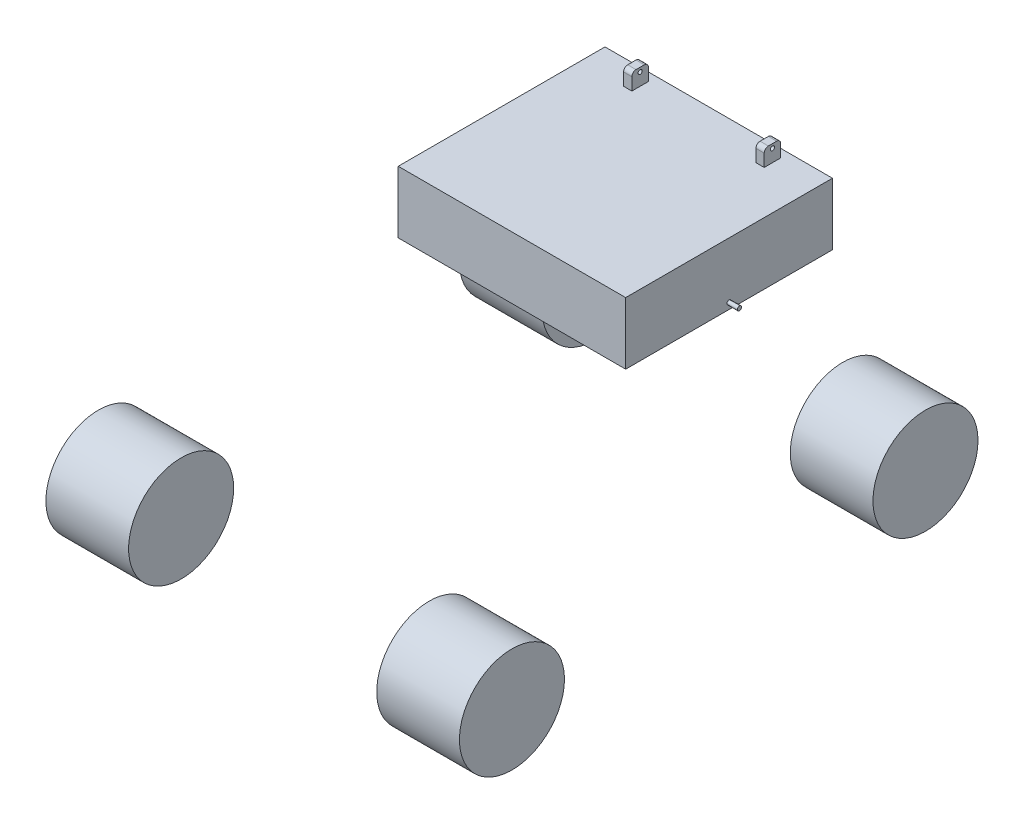
ISO-10303-21;
HEADER;
FILE_DESCRIPTION(('STEP AP214'),'2;1');
FILE_NAME('part.step','',(''),(''),'','','');
FILE_SCHEMA(('AUTOMOTIVE_DESIGN { 1 0 10303 214 1 1 1 1 }'));
ENDSEC;
DATA;
#1=APPLICATION_CONTEXT('core data for automotive mechanical design processes');
#2=APPLICATION_PROTOCOL_DEFINITION('international standard','automotive_design',2000,#1);
#3=PRODUCT_CONTEXT('',#1,'mechanical');
#4=PRODUCT('Part','Part','',(#3));
#5=PRODUCT_RELATED_PRODUCT_CATEGORY('part','',(#4));
#6=PRODUCT_DEFINITION_FORMATION('','',#4);
#7=PRODUCT_DEFINITION_CONTEXT('part definition',#1,'design');
#8=PRODUCT_DEFINITION('design','',#6,#7);
#9=PRODUCT_DEFINITION_SHAPE('','',#8);
#10=(LENGTH_UNIT() NAMED_UNIT(*) SI_UNIT(.MILLI.,.METRE.));
#11=(NAMED_UNIT(*) PLANE_ANGLE_UNIT() SI_UNIT($,.RADIAN.));
#12=(NAMED_UNIT(*) SI_UNIT($,.STERADIAN.) SOLID_ANGLE_UNIT());
#13=UNCERTAINTY_MEASURE_WITH_UNIT(LENGTH_MEASURE(1.E-05),#10,'distance_accuracy_value','');
#14=(GEOMETRIC_REPRESENTATION_CONTEXT(3) GLOBAL_UNCERTAINTY_ASSIGNED_CONTEXT((#13)) GLOBAL_UNIT_ASSIGNED_CONTEXT((#10,
#11,#12)) REPRESENTATION_CONTEXT('',''));
#15=CARTESIAN_POINT('',(0.,0.,0.));
#16=DIRECTION('',(0.,0.,1.));
#17=DIRECTION('',(1.,0.,0.));
#18=AXIS2_PLACEMENT_3D('',#15,#16,#17);
#19=CARTESIAN_POINT('',(275.,500.,0.));
#20=DIRECTION('',(0.,-1.,0.));
#21=DIRECTION('',(0.,0.,-1.));
#22=AXIS2_PLACEMENT_3D('',#19,#20,#21);
#23=PLANE('',#22);
#24=DIRECTION('',(0.,0.,1.));
#25=VECTOR('',#24,1.);
#26=CARTESIAN_POINT('',(-170.,500.,-440.));
#27=LINE('',#26,#25);
#28=CARTESIAN_POINT('',(-170.,500.,-480.));
#29=VERTEX_POINT('',#28);
#30=CARTESIAN_POINT('',(-170.,500.,-440.));
#31=VERTEX_POINT('',#30);
#32=EDGE_CURVE('E186',#29,#31,#27,.T.);
#33=ORIENTED_EDGE('',*,*,#32,.F.);
#34=DIRECTION('',(-1.,0.,0.));
#35=VECTOR('',#34,1.);
#36=CARTESIAN_POINT('',(-170.,500.,-480.));
#37=LINE('',#36,#35);
#38=CARTESIAN_POINT('',(-150.,500.,-480.));
#39=VERTEX_POINT('',#38);
#40=EDGE_CURVE('E205',#39,#29,#37,.T.);
#41=ORIENTED_EDGE('',*,*,#40,.F.);
#42=DIRECTION('',(0.,0.,-1.));
#43=VECTOR('',#42,1.);
#44=CARTESIAN_POINT('',(-150.,500.,-440.));
#45=LINE('',#44,#43);
#46=CARTESIAN_POINT('',(-150.,500.,-440.));
#47=VERTEX_POINT('',#46);
#48=EDGE_CURVE('E214',#47,#39,#45,.T.);
#49=ORIENTED_EDGE('',*,*,#48,.F.);
#50=DIRECTION('',(1.,0.,0.));
#51=VECTOR('',#50,1.);
#52=CARTESIAN_POINT('',(-170.,500.,-440.));
#53=LINE('',#52,#51);
#54=EDGE_CURVE('E211',#31,#47,#53,.T.);
#55=ORIENTED_EDGE('',*,*,#54,.F.);
#56=EDGE_LOOP('',(#33,#41,#49,#55));
#57=FACE_BOUND('',#56,.T.);
#58=DIRECTION('',(0.,0.,1.));
#59=VECTOR('',#58,1.);
#60=CARTESIAN_POINT('',(-275.,500.,0.));
#61=LINE('',#60,#59);
#62=CARTESIAN_POINT('',(-275.,500.,-500.));
#63=VERTEX_POINT('',#62);
#64=CARTESIAN_POINT('',(-275.,500.,0.));
#65=VERTEX_POINT('',#64);
#66=EDGE_CURVE('E240',#63,#65,#61,.T.);
#67=ORIENTED_EDGE('',*,*,#66,.T.);
#68=DIRECTION('',(-1.,0.,0.));
#69=VECTOR('',#68,1.);
#70=CARTESIAN_POINT('',(275.,500.,0.));
#71=LINE('',#70,#69);
#72=CARTESIAN_POINT('',(275.,500.,0.));
#73=VERTEX_POINT('',#72);
#74=EDGE_CURVE('E246',#73,#65,#71,.T.);
#75=ORIENTED_EDGE('',*,*,#74,.F.);
#76=DIRECTION('',(0.,0.,1.));
#77=VECTOR('',#76,1.);
#78=CARTESIAN_POINT('',(275.,500.,0.));
#79=LINE('',#78,#77);
#80=CARTESIAN_POINT('',(275.,500.,-500.));
#81=VERTEX_POINT('',#80);
#82=EDGE_CURVE('E244',#81,#73,#79,.T.);
#83=ORIENTED_EDGE('',*,*,#82,.F.);
#84=DIRECTION('',(-1.,0.,0.));
#85=VECTOR('',#84,1.);
#86=CARTESIAN_POINT('',(275.,500.,-500.));
#87=LINE('',#86,#85);
#88=EDGE_CURVE('E256',#81,#63,#87,.T.);
#89=ORIENTED_EDGE('',*,*,#88,.T.);
#90=EDGE_LOOP('',(#67,#75,#83,#89));
#91=FACE_BOUND('',#90,.T.);
#92=DIRECTION('',(0.,0.,1.));
#93=VECTOR('',#92,1.);
#94=CARTESIAN_POINT('',(150.,500.,-440.));
#95=LINE('',#94,#93);
#96=CARTESIAN_POINT('',(150.,500.,-480.));
#97=VERTEX_POINT('',#96);
#98=CARTESIAN_POINT('',(150.,500.,-440.));
#99=VERTEX_POINT('',#98);
#100=EDGE_CURVE('E169',#97,#99,#95,.T.);
#101=ORIENTED_EDGE('',*,*,#100,.F.);
#102=DIRECTION('',(-1.,0.,0.));
#103=VECTOR('',#102,1.);
#104=CARTESIAN_POINT('',(150.,500.,-480.));
#105=LINE('',#104,#103);
#106=CARTESIAN_POINT('',(170.,500.,-480.));
#107=VERTEX_POINT('',#106);
#108=EDGE_CURVE('E182',#107,#97,#105,.T.);
#109=ORIENTED_EDGE('',*,*,#108,.F.);
#110=DIRECTION('',(0.,0.,-1.));
#111=VECTOR('',#110,1.);
#112=CARTESIAN_POINT('',(170.,500.,-440.));
#113=LINE('',#112,#111);
#114=CARTESIAN_POINT('',(170.,500.,-440.));
#115=VERTEX_POINT('',#114);
#116=EDGE_CURVE('E190',#115,#107,#113,.T.);
#117=ORIENTED_EDGE('',*,*,#116,.F.);
#118=DIRECTION('',(1.,0.,0.));
#119=VECTOR('',#118,1.);
#120=CARTESIAN_POINT('',(150.,500.,-440.));
#121=LINE('',#120,#119);
#122=EDGE_CURVE('E185',#99,#115,#121,.T.);
#123=ORIENTED_EDGE('',*,*,#122,.F.);
#124=EDGE_LOOP('',(#101,#109,#117,#123));
#125=FACE_BOUND('',#124,.T.);
#126=ADVANCED_FACE('F52',(#57,#91,#125),#23,.F.);
#127=CARTESIAN_POINT('',(275.,500.,0.));
#128=DIRECTION('',(0.,0.,-1.));
#129=DIRECTION('',(0.,1.,0.));
#130=AXIS2_PLACEMENT_3D('',#127,#128,#129);
#131=PLANE('',#130);
#132=DIRECTION('',(0.,-1.,0.));
#133=VECTOR('',#132,1.);
#134=CARTESIAN_POINT('',(-275.,500.,0.));
#135=LINE('',#134,#133);
#136=CARTESIAN_POINT('',(-275.,350.,0.));
#137=VERTEX_POINT('',#136);
#138=EDGE_CURVE('E235',#65,#137,#135,.T.);
#139=ORIENTED_EDGE('',*,*,#138,.T.);
#140=DIRECTION('',(-1.,0.,0.));
#141=VECTOR('',#140,1.);
#142=CARTESIAN_POINT('',(275.,350.,0.));
#143=LINE('',#142,#141);
#144=CARTESIAN_POINT('',(275.,350.,0.));
#145=VERTEX_POINT('',#144);
#146=EDGE_CURVE('E262',#145,#137,#143,.T.);
#147=ORIENTED_EDGE('',*,*,#146,.F.);
#148=DIRECTION('',(0.,-1.,0.));
#149=VECTOR('',#148,1.);
#150=CARTESIAN_POINT('',(275.,500.,0.));
#151=LINE('',#150,#149);
#152=EDGE_CURVE('E236',#73,#145,#151,.T.);
#153=ORIENTED_EDGE('',*,*,#152,.F.);
#154=ORIENTED_EDGE('',*,*,#74,.T.);
#155=EDGE_LOOP('',(#139,#147,#153,#154));
#156=FACE_BOUND('',#155,.T.);
#157=ADVANCED_FACE('F332',(#156),#131,.F.);
#158=CARTESIAN_POINT('',(275.,350.,0.));
#159=DIRECTION('',(0.,1.,0.));
#160=DIRECTION('',(0.,0.,1.));
#161=AXIS2_PLACEMENT_3D('',#158,#159,#160);
#162=PLANE('',#161);
#163=DIRECTION('',(0.,0.,-1.));
#164=VECTOR('',#163,1.);
#165=CARTESIAN_POINT('',(-275.,350.,0.));
#166=LINE('',#165,#164);
#167=CARTESIAN_POINT('',(-275.,350.,-500.));
#168=VERTEX_POINT('',#167);
#169=EDGE_CURVE('E249',#137,#168,#166,.T.);
#170=ORIENTED_EDGE('',*,*,#169,.T.);
#171=DIRECTION('',(-1.,0.,0.));
#172=VECTOR('',#171,1.);
#173=CARTESIAN_POINT('',(275.,350.,-500.));
#174=LINE('',#173,#172);
#175=CARTESIAN_POINT('',(275.,350.,-500.));
#176=VERTEX_POINT('',#175);
#177=EDGE_CURVE('E259',#176,#168,#174,.T.);
#178=ORIENTED_EDGE('',*,*,#177,.F.);
#179=DIRECTION('',(0.,0.,-1.));
#180=VECTOR('',#179,1.);
#181=CARTESIAN_POINT('',(275.,350.,0.));
#182=LINE('',#181,#180);
#183=EDGE_CURVE('E239',#145,#176,#182,.T.);
#184=ORIENTED_EDGE('',*,*,#183,.F.);
#185=ORIENTED_EDGE('',*,*,#146,.T.);
#186=EDGE_LOOP('',(#170,#178,#184,#185));
#187=FACE_BOUND('',#186,.T.);
#188=ADVANCED_FACE('F339',(#187),#162,.F.);
#189=CARTESIAN_POINT('',(275.,500.,-500.));
#190=DIRECTION('',(0.,0.,1.));
#191=DIRECTION('',(0.,-1.,0.));
#192=AXIS2_PLACEMENT_3D('',#189,#190,#191);
#193=PLANE('',#192);
#194=DIRECTION('',(0.,1.,0.));
#195=VECTOR('',#194,1.);
#196=CARTESIAN_POINT('',(-275.,500.,-500.));
#197=LINE('',#196,#195);
#198=EDGE_CURVE('E251',#168,#63,#197,.T.);
#199=ORIENTED_EDGE('',*,*,#198,.T.);
#200=ORIENTED_EDGE('',*,*,#88,.F.);
#201=DIRECTION('',(0.,1.,0.));
#202=VECTOR('',#201,1.);
#203=CARTESIAN_POINT('',(275.,500.,-500.));
#204=LINE('',#203,#202);
#205=EDGE_CURVE('E242',#176,#81,#204,.T.);
#206=ORIENTED_EDGE('',*,*,#205,.F.);
#207=ORIENTED_EDGE('',*,*,#177,.T.);
#208=EDGE_LOOP('',(#199,#200,#206,#207));
#209=FACE_BOUND('',#208,.T.);
#210=ADVANCED_FACE('F346',(#209),#193,.F.);
#211=CARTESIAN_POINT('',(275.,0.,0.));
#212=DIRECTION('',(1.,0.,0.));
#213=DIRECTION('',(0.,0.,-1.));
#214=AXIS2_PLACEMENT_3D('',#211,#212,#213);
#215=PLANE('',#214);
#216=CARTESIAN_POINT('',(275.,365.,-250.));
#217=DIRECTION('',(1.,0.,0.));
#218=DIRECTION('',(0.,0.,-1.));
#219=AXIS2_PLACEMENT_3D('',#216,#217,#218);
#220=CIRCLE('',#219,4.99999999999997);
#221=CARTESIAN_POINT('',(275.,365.,-255.));
#222=VERTEX_POINT('',#221);
#223=EDGE_CURVE('E229',#222,#222,#220,.T.);
#224=ORIENTED_EDGE('',*,*,#223,.F.);
#225=EDGE_LOOP('',(#224));
#226=FACE_BOUND('',#225,.T.);
#227=ORIENTED_EDGE('',*,*,#152,.T.);
#228=ORIENTED_EDGE('',*,*,#183,.T.);
#229=ORIENTED_EDGE('',*,*,#205,.T.);
#230=ORIENTED_EDGE('',*,*,#82,.T.);
#231=EDGE_LOOP('',(#227,#228,#229,#230));
#232=FACE_BOUND('',#231,.T.);
#233=ADVANCED_FACE('F349',(#226,#232),#215,.T.);
#234=CARTESIAN_POINT('',(-275.,0.,0.));
#235=DIRECTION('',(1.,0.,0.));
#236=DIRECTION('',(0.,0.,-1.));
#237=AXIS2_PLACEMENT_3D('',#234,#235,#236);
#238=PLANE('',#237);
#239=CARTESIAN_POINT('',(-275.,365.,-250.));
#240=DIRECTION('',(1.,0.,0.));
#241=DIRECTION('',(0.,0.,-1.));
#242=AXIS2_PLACEMENT_3D('',#239,#240,#241);
#243=CIRCLE('',#242,4.99999999999997);
#244=CARTESIAN_POINT('',(-275.,365.,-255.));
#245=VERTEX_POINT('',#244);
#246=EDGE_CURVE('E265',#245,#245,#243,.F.);
#247=ORIENTED_EDGE('',*,*,#246,.F.);
#248=EDGE_LOOP('',(#247));
#249=FACE_BOUND('',#248,.T.);
#250=ORIENTED_EDGE('',*,*,#138,.F.);
#251=ORIENTED_EDGE('',*,*,#66,.F.);
#252=ORIENTED_EDGE('',*,*,#198,.F.);
#253=ORIENTED_EDGE('',*,*,#169,.F.);
#254=EDGE_LOOP('',(#250,#251,#252,#253));
#255=FACE_BOUND('',#254,.T.);
#256=ADVANCED_FACE('F344',(#249,#255),#238,.F.);
#257=CARTESIAN_POINT('',(314.142135623731,365.,-250.));
#258=DIRECTION('',(-1.,0.,0.));
#259=DIRECTION('',(0.,0.,1.));
#260=AXIS2_PLACEMENT_3D('',#257,#258,#259);
#261=CYLINDRICAL_SURFACE('',#260,4.99999999999997);
#262=ORIENTED_EDGE('',*,*,#223,.T.);
#263=EDGE_LOOP('',(#262));
#264=FACE_BOUND('',#263,.T.);
#265=CARTESIAN_POINT('',(300.,365.,-250.));
#266=DIRECTION('',(1.,0.,0.));
#267=DIRECTION('',(0.,0.,-1.));
#268=AXIS2_PLACEMENT_3D('',#265,#266,#267);
#269=CIRCLE('',#268,4.99999999999997);
#270=CARTESIAN_POINT('',(300.,365.,-255.));
#271=VERTEX_POINT('',#270);
#272=EDGE_CURVE('E232',#271,#271,#269,.T.);
#273=ORIENTED_EDGE('',*,*,#272,.F.);
#274=EDGE_LOOP('',(#273));
#275=FACE_BOUND('',#274,.T.);
#276=ADVANCED_FACE('F425',(#264,#275),#261,.T.);
#277=CARTESIAN_POINT('',(300.,0.,-500.));
#278=DIRECTION('',(1.,0.,0.));
#279=DIRECTION('',(0.,0.,-1.));
#280=AXIS2_PLACEMENT_3D('',#277,#278,#279);
#281=PLANE('',#280);
#282=ORIENTED_EDGE('',*,*,#272,.T.);
#283=EDGE_LOOP('',(#282));
#284=FACE_BOUND('',#283,.T.);
#285=ADVANCED_FACE('F423',(#284),#281,.T.);
#286=CARTESIAN_POINT('',(-314.142135623731,365.,-250.));
#287=DIRECTION('',(1.,0.,0.));
#288=DIRECTION('',(0.,0.,1.));
#289=AXIS2_PLACEMENT_3D('',#286,#287,#288);
#290=CYLINDRICAL_SURFACE('',#289,4.99999999999997);
#291=ORIENTED_EDGE('',*,*,#246,.T.);
#292=EDGE_LOOP('',(#291));
#293=FACE_BOUND('',#292,.T.);
#294=CARTESIAN_POINT('',(-300.,365.,-250.));
#295=DIRECTION('',(1.,0.,0.));
#296=DIRECTION('',(0.,0.,-1.));
#297=AXIS2_PLACEMENT_3D('',#294,#295,#296);
#298=CIRCLE('',#297,4.99999999999997);
#299=CARTESIAN_POINT('',(-300.,365.,-255.));
#300=VERTEX_POINT('',#299);
#301=EDGE_CURVE('E226',#300,#300,#298,.T.);
#302=ORIENTED_EDGE('',*,*,#301,.T.);
#303=EDGE_LOOP('',(#302));
#304=FACE_BOUND('',#303,.T.);
#305=ADVANCED_FACE('F419',(#293,#304),#290,.T.);
#306=CARTESIAN_POINT('',(-300.,0.,-500.));
#307=DIRECTION('',(-1.,0.,0.));
#308=DIRECTION('',(0.,0.,-1.));
#309=AXIS2_PLACEMENT_3D('',#306,#307,#308);
#310=PLANE('',#309);
#311=ORIENTED_EDGE('',*,*,#301,.F.);
#312=EDGE_LOOP('',(#311));
#313=FACE_BOUND('',#312,.T.);
#314=ADVANCED_FACE('F416',(#313),#310,.T.);
#315=CARTESIAN_POINT('',(-170.,540.,-440.));
#316=DIRECTION('',(1.,0.,0.));
#317=DIRECTION('',(0.,0.,-1.));
#318=AXIS2_PLACEMENT_3D('',#315,#316,#317);
#319=PLANE('',#318);
#320=CARTESIAN_POINT('',(-170.,530.,-460.));
#321=DIRECTION('',(1.,0.,0.));
#322=DIRECTION('',(0.,0.,-1.));
#323=AXIS2_PLACEMENT_3D('',#320,#321,#322);
#324=CIRCLE('',#323,4.99999999999999);
#325=CARTESIAN_POINT('',(-170.,530.,-465.));
#326=VERTEX_POINT('',#325);
#327=EDGE_CURVE('E378',#326,#326,#324,.T.);
#328=ORIENTED_EDGE('',*,*,#327,.T.);
#329=EDGE_LOOP('',(#328));
#330=FACE_BOUND('',#329,.T.);
#331=DIRECTION('',(0.,-1.,0.));
#332=VECTOR('',#331,1.);
#333=CARTESIAN_POINT('',(-170.,540.,-440.));
#334=LINE('',#333,#332);
#335=CARTESIAN_POINT('',(-170.,530.,-440.));
#336=VERTEX_POINT('',#335);
#337=EDGE_CURVE('E224',#336,#31,#334,.T.);
#338=ORIENTED_EDGE('',*,*,#337,.F.);
#339=CARTESIAN_POINT('',(-170.,530.,-450.));
#340=DIRECTION('',(1.,0.,0.));
#341=DIRECTION('',(0.,0.,-1.));
#342=AXIS2_PLACEMENT_3D('',#339,#340,#341);
#343=CIRCLE('',#342,10.);
#344=CARTESIAN_POINT('',(-170.,540.,-450.));
#345=VERTEX_POINT('',#344);
#346=EDGE_CURVE('E60',#336,#345,#343,.F.);
#347=ORIENTED_EDGE('',*,*,#346,.T.);
#348=DIRECTION('',(0.,0.,1.));
#349=VECTOR('',#348,1.);
#350=CARTESIAN_POINT('',(-170.,540.,-440.));
#351=LINE('',#350,#349);
#352=CARTESIAN_POINT('',(-170.,540.,-470.));
#353=VERTEX_POINT('',#352);
#354=EDGE_CURVE('E201',#353,#345,#351,.T.);
#355=ORIENTED_EDGE('',*,*,#354,.F.);
#356=CARTESIAN_POINT('',(-170.,530.,-470.));
#357=DIRECTION('',(1.,0.,0.));
#358=DIRECTION('',(0.,0.,-1.));
#359=AXIS2_PLACEMENT_3D('',#356,#357,#358);
#360=CIRCLE('',#359,10.);
#361=CARTESIAN_POINT('',(-170.,530.,-480.));
#362=VERTEX_POINT('',#361);
#363=EDGE_CURVE('E67',#353,#362,#360,.F.);
#364=ORIENTED_EDGE('',*,*,#363,.T.);
#365=DIRECTION('',(0.,-1.,0.));
#366=VECTOR('',#365,1.);
#367=CARTESIAN_POINT('',(-170.,540.,-480.));
#368=LINE('',#367,#366);
#369=EDGE_CURVE('E208',#362,#29,#368,.T.);
#370=ORIENTED_EDGE('',*,*,#369,.T.);
#371=ORIENTED_EDGE('',*,*,#32,.T.);
#372=EDGE_LOOP('',(#338,#347,#355,#364,#370,#371));
#373=FACE_BOUND('',#372,.T.);
#374=ADVANCED_FACE('F297',(#330,#373),#319,.F.);
#375=CARTESIAN_POINT('',(-170.,540.,-440.));
#376=DIRECTION('',(0.,0.,-1.));
#377=DIRECTION('',(0.,1.,0.));
#378=AXIS2_PLACEMENT_3D('',#375,#376,#377);
#379=PLANE('',#378);
#380=DIRECTION('',(0.,-1.,0.));
#381=VECTOR('',#380,1.);
#382=CARTESIAN_POINT('',(-150.,540.,-440.));
#383=LINE('',#382,#381);
#384=CARTESIAN_POINT('',(-150.,530.,-440.));
#385=VERTEX_POINT('',#384);
#386=EDGE_CURVE('E222',#385,#47,#383,.T.);
#387=ORIENTED_EDGE('',*,*,#386,.F.);
#388=DIRECTION('',(1.,0.,0.));
#389=VECTOR('',#388,1.);
#390=CARTESIAN_POINT('',(-170.,530.,-440.));
#391=LINE('',#390,#389);
#392=EDGE_CURVE('E75',#385,#336,#391,.F.);
#393=ORIENTED_EDGE('',*,*,#392,.T.);
#394=ORIENTED_EDGE('',*,*,#337,.T.);
#395=ORIENTED_EDGE('',*,*,#54,.T.);
#396=EDGE_LOOP('',(#387,#393,#394,#395));
#397=FACE_BOUND('',#396,.T.);
#398=ADVANCED_FACE('F308',(#397),#379,.F.);
#399=CARTESIAN_POINT('',(-150.,540.,-440.));
#400=DIRECTION('',(-1.,0.,0.));
#401=DIRECTION('',(0.,0.,1.));
#402=AXIS2_PLACEMENT_3D('',#399,#400,#401);
#403=PLANE('',#402);
#404=CARTESIAN_POINT('',(-150.,530.,-460.));
#405=DIRECTION('',(-1.,0.,0.));
#406=DIRECTION('',(0.,0.,1.));
#407=AXIS2_PLACEMENT_3D('',#404,#405,#406);
#408=CIRCLE('',#407,4.99999999999999);
#409=CARTESIAN_POINT('',(-150.,530.,-455.));
#410=VERTEX_POINT('',#409);
#411=EDGE_CURVE('E383',#410,#410,#408,.T.);
#412=ORIENTED_EDGE('',*,*,#411,.T.);
#413=EDGE_LOOP('',(#412));
#414=FACE_BOUND('',#413,.T.);
#415=DIRECTION('',(0.,0.,-1.));
#416=VECTOR('',#415,1.);
#417=CARTESIAN_POINT('',(-150.,540.,-440.));
#418=LINE('',#417,#416);
#419=CARTESIAN_POINT('',(-150.,540.,-450.));
#420=VERTEX_POINT('',#419);
#421=CARTESIAN_POINT('',(-150.,540.,-470.));
#422=VERTEX_POINT('',#421);
#423=EDGE_CURVE('E204',#420,#422,#418,.T.);
#424=ORIENTED_EDGE('',*,*,#423,.F.);
#425=CARTESIAN_POINT('',(-150.,530.,-450.));
#426=DIRECTION('',(-1.,0.,0.));
#427=DIRECTION('',(0.,0.,1.));
#428=AXIS2_PLACEMENT_3D('',#425,#426,#427);
#429=CIRCLE('',#428,10.);
#430=EDGE_CURVE('E293',#420,#385,#429,.F.);
#431=ORIENTED_EDGE('',*,*,#430,.T.);
#432=ORIENTED_EDGE('',*,*,#386,.T.);
#433=ORIENTED_EDGE('',*,*,#48,.T.);
#434=DIRECTION('',(0.,-1.,0.));
#435=VECTOR('',#434,1.);
#436=CARTESIAN_POINT('',(-150.,540.,-480.));
#437=LINE('',#436,#435);
#438=CARTESIAN_POINT('',(-150.,530.,-480.));
#439=VERTEX_POINT('',#438);
#440=EDGE_CURVE('E220',#439,#39,#437,.T.);
#441=ORIENTED_EDGE('',*,*,#440,.F.);
#442=CARTESIAN_POINT('',(-150.,530.,-470.));
#443=DIRECTION('',(-1.,0.,0.));
#444=DIRECTION('',(0.,0.,1.));
#445=AXIS2_PLACEMENT_3D('',#442,#443,#444);
#446=CIRCLE('',#445,10.);
#447=EDGE_CURVE('E291',#439,#422,#446,.F.);
#448=ORIENTED_EDGE('',*,*,#447,.T.);
#449=EDGE_LOOP('',(#424,#431,#432,#433,#441,#448));
#450=FACE_BOUND('',#449,.T.);
#451=ADVANCED_FACE('F306',(#414,#450),#403,.F.);
#452=CARTESIAN_POINT('',(-170.,540.,-480.));
#453=DIRECTION('',(0.,0.,1.));
#454=DIRECTION('',(1.,0.,0.));
#455=AXIS2_PLACEMENT_3D('',#452,#453,#454);
#456=PLANE('',#455);
#457=ORIENTED_EDGE('',*,*,#369,.F.);
#458=DIRECTION('',(-1.,0.,0.));
#459=VECTOR('',#458,1.);
#460=CARTESIAN_POINT('',(-170.,530.,-480.));
#461=LINE('',#460,#459);
#462=EDGE_CURVE('E12',#362,#439,#461,.F.);
#463=ORIENTED_EDGE('',*,*,#462,.T.);
#464=ORIENTED_EDGE('',*,*,#440,.T.);
#465=ORIENTED_EDGE('',*,*,#40,.T.);
#466=EDGE_LOOP('',(#457,#463,#464,#465));
#467=FACE_BOUND('',#466,.T.);
#468=ADVANCED_FACE('F316',(#467),#456,.F.);
#469=CARTESIAN_POINT('',(0.,540.,0.));
#470=DIRECTION('',(0.,-1.,0.));
#471=DIRECTION('',(0.,0.,-1.));
#472=AXIS2_PLACEMENT_3D('',#469,#470,#471);
#473=PLANE('',#472);
#474=ORIENTED_EDGE('',*,*,#354,.T.);
#475=DIRECTION('',(1.,0.,0.));
#476=VECTOR('',#475,1.);
#477=CARTESIAN_POINT('',(0.,540.,-450.));
#478=LINE('',#477,#476);
#479=EDGE_CURVE('E288',#345,#420,#478,.T.);
#480=ORIENTED_EDGE('',*,*,#479,.T.);
#481=ORIENTED_EDGE('',*,*,#423,.T.);
#482=DIRECTION('',(-1.,0.,0.));
#483=VECTOR('',#482,1.);
#484=CARTESIAN_POINT('',(1.30451205393456E-12,540.,-470.));
#485=LINE('',#484,#483);
#486=EDGE_CURVE('E285',#422,#353,#485,.T.);
#487=ORIENTED_EDGE('',*,*,#486,.T.);
#488=EDGE_LOOP('',(#474,#480,#481,#487));
#489=FACE_BOUND('',#488,.T.);
#490=ADVANCED_FACE('F301',(#489),#473,.F.);
#491=CARTESIAN_POINT('',(150.,540.,-440.));
#492=DIRECTION('',(1.,0.,0.));
#493=DIRECTION('',(0.,0.,-1.));
#494=AXIS2_PLACEMENT_3D('',#491,#492,#493);
#495=PLANE('',#494);
#496=CARTESIAN_POINT('',(150.,530.,-460.));
#497=DIRECTION('',(1.,0.,0.));
#498=DIRECTION('',(0.,0.,-1.));
#499=AXIS2_PLACEMENT_3D('',#496,#497,#498);
#500=CIRCLE('',#499,4.99999999999999);
#501=CARTESIAN_POINT('',(150.,530.,-465.));
#502=VERTEX_POINT('',#501);
#503=EDGE_CURVE('E386',#502,#502,#500,.T.);
#504=ORIENTED_EDGE('',*,*,#503,.T.);
#505=EDGE_LOOP('',(#504));
#506=FACE_BOUND('',#505,.T.);
#507=DIRECTION('',(0.,-1.,0.));
#508=VECTOR('',#507,1.);
#509=CARTESIAN_POINT('',(150.,540.,-440.));
#510=LINE('',#509,#508);
#511=CARTESIAN_POINT('',(150.,530.,-440.));
#512=VERTEX_POINT('',#511);
#513=EDGE_CURVE('E376',#512,#99,#510,.T.);
#514=ORIENTED_EDGE('',*,*,#513,.F.);
#515=CARTESIAN_POINT('',(150.,530.,-450.));
#516=DIRECTION('',(1.,0.,0.));
#517=DIRECTION('',(0.,0.,-1.));
#518=AXIS2_PLACEMENT_3D('',#515,#516,#517);
#519=CIRCLE('',#518,10.);
#520=CARTESIAN_POINT('',(150.,540.,-450.));
#521=VERTEX_POINT('',#520);
#522=EDGE_CURVE('E281',#512,#521,#519,.F.);
#523=ORIENTED_EDGE('',*,*,#522,.T.);
#524=DIRECTION('',(0.,0.,1.));
#525=VECTOR('',#524,1.);
#526=CARTESIAN_POINT('',(150.,540.,-440.));
#527=LINE('',#526,#525);
#528=CARTESIAN_POINT('',(150.,540.,-470.));
#529=VERTEX_POINT('',#528);
#530=EDGE_CURVE('E191',#529,#521,#527,.T.);
#531=ORIENTED_EDGE('',*,*,#530,.F.);
#532=CARTESIAN_POINT('',(150.,530.,-470.));
#533=DIRECTION('',(1.,0.,0.));
#534=DIRECTION('',(0.,0.,-1.));
#535=AXIS2_PLACEMENT_3D('',#532,#533,#534);
#536=CIRCLE('',#535,10.);
#537=CARTESIAN_POINT('',(150.,530.,-480.));
#538=VERTEX_POINT('',#537);
#539=EDGE_CURVE('E171',#529,#538,#536,.F.);
#540=ORIENTED_EDGE('',*,*,#539,.T.);
#541=DIRECTION('',(0.,-1.,0.));
#542=VECTOR('',#541,1.);
#543=CARTESIAN_POINT('',(150.,540.,-480.));
#544=LINE('',#543,#542);
#545=EDGE_CURVE('E165',#538,#97,#544,.T.);
#546=ORIENTED_EDGE('',*,*,#545,.T.);
#547=ORIENTED_EDGE('',*,*,#100,.T.);
#548=EDGE_LOOP('',(#514,#523,#531,#540,#546,#547));
#549=FACE_BOUND('',#548,.T.);
#550=ADVANCED_FACE('F168',(#506,#549),#495,.F.);
#551=CARTESIAN_POINT('',(150.,540.,-440.));
#552=DIRECTION('',(0.,0.,-1.));
#553=DIRECTION('',(0.,1.,0.));
#554=AXIS2_PLACEMENT_3D('',#551,#552,#553);
#555=PLANE('',#554);
#556=DIRECTION('',(0.,-1.,0.));
#557=VECTOR('',#556,1.);
#558=CARTESIAN_POINT('',(170.,540.,-440.));
#559=LINE('',#558,#557);
#560=CARTESIAN_POINT('',(170.,530.,-440.));
#561=VERTEX_POINT('',#560);
#562=EDGE_CURVE('E373',#561,#115,#559,.T.);
#563=ORIENTED_EDGE('',*,*,#562,.F.);
#564=DIRECTION('',(1.,0.,0.));
#565=VECTOR('',#564,1.);
#566=CARTESIAN_POINT('',(150.,530.,-440.));
#567=LINE('',#566,#565);
#568=EDGE_CURVE('E278',#561,#512,#567,.F.);
#569=ORIENTED_EDGE('',*,*,#568,.T.);
#570=ORIENTED_EDGE('',*,*,#513,.T.);
#571=ORIENTED_EDGE('',*,*,#122,.T.);
#572=EDGE_LOOP('',(#563,#569,#570,#571));
#573=FACE_BOUND('',#572,.T.);
#574=ADVANCED_FACE('F375',(#573),#555,.F.);
#575=CARTESIAN_POINT('',(170.,540.,-440.));
#576=DIRECTION('',(-1.,0.,0.));
#577=DIRECTION('',(0.,0.,1.));
#578=AXIS2_PLACEMENT_3D('',#575,#576,#577);
#579=PLANE('',#578);
#580=CARTESIAN_POINT('',(170.,530.,-460.));
#581=DIRECTION('',(1.,0.,0.));
#582=DIRECTION('',(0.,0.,-1.));
#583=AXIS2_PLACEMENT_3D('',#580,#581,#582);
#584=CIRCLE('',#583,4.99999999999999);
#585=CARTESIAN_POINT('',(170.,530.,-465.));
#586=VERTEX_POINT('',#585);
#587=EDGE_CURVE('E389',#586,#586,#584,.T.);
#588=ORIENTED_EDGE('',*,*,#587,.F.);
#589=EDGE_LOOP('',(#588));
#590=FACE_BOUND('',#589,.T.);
#591=DIRECTION('',(0.,0.,-1.));
#592=VECTOR('',#591,1.);
#593=CARTESIAN_POINT('',(170.,540.,-440.));
#594=LINE('',#593,#592);
#595=CARTESIAN_POINT('',(170.,540.,-450.));
#596=VERTEX_POINT('',#595);
#597=CARTESIAN_POINT('',(170.,540.,-470.));
#598=VERTEX_POINT('',#597);
#599=EDGE_CURVE('E175',#596,#598,#594,.T.);
#600=ORIENTED_EDGE('',*,*,#599,.F.);
#601=CARTESIAN_POINT('',(170.,530.,-450.));
#602=DIRECTION('',(-1.,0.,0.));
#603=DIRECTION('',(0.,0.,1.));
#604=AXIS2_PLACEMENT_3D('',#601,#602,#603);
#605=CIRCLE('',#604,10.);
#606=EDGE_CURVE('E276',#596,#561,#605,.F.);
#607=ORIENTED_EDGE('',*,*,#606,.T.);
#608=ORIENTED_EDGE('',*,*,#562,.T.);
#609=ORIENTED_EDGE('',*,*,#116,.T.);
#610=DIRECTION('',(0.,-1.,0.));
#611=VECTOR('',#610,1.);
#612=CARTESIAN_POINT('',(170.,540.,-480.));
#613=LINE('',#612,#611);
#614=CARTESIAN_POINT('',(170.,530.,-480.));
#615=VERTEX_POINT('',#614);
#616=EDGE_CURVE('E176',#615,#107,#613,.T.);
#617=ORIENTED_EDGE('',*,*,#616,.F.);
#618=CARTESIAN_POINT('',(170.,530.,-470.));
#619=DIRECTION('',(-1.,0.,0.));
#620=DIRECTION('',(0.,0.,1.));
#621=AXIS2_PLACEMENT_3D('',#618,#619,#620);
#622=CIRCLE('',#621,10.);
#623=EDGE_CURVE('E274',#615,#598,#622,.F.);
#624=ORIENTED_EDGE('',*,*,#623,.T.);
#625=EDGE_LOOP('',(#600,#607,#608,#609,#617,#624));
#626=FACE_BOUND('',#625,.T.);
#627=ADVANCED_FACE('F367',(#590,#626),#579,.F.);
#628=CARTESIAN_POINT('',(150.,540.,-480.));
#629=DIRECTION('',(0.,0.,1.));
#630=DIRECTION('',(0.,-1.,0.));
#631=AXIS2_PLACEMENT_3D('',#628,#629,#630);
#632=PLANE('',#631);
#633=ORIENTED_EDGE('',*,*,#545,.F.);
#634=DIRECTION('',(-1.,0.,0.));
#635=VECTOR('',#634,1.);
#636=CARTESIAN_POINT('',(150.,530.,-480.));
#637=LINE('',#636,#635);
#638=EDGE_CURVE('E283',#538,#615,#637,.F.);
#639=ORIENTED_EDGE('',*,*,#638,.T.);
#640=ORIENTED_EDGE('',*,*,#616,.T.);
#641=ORIENTED_EDGE('',*,*,#108,.T.);
#642=EDGE_LOOP('',(#633,#639,#640,#641));
#643=FACE_BOUND('',#642,.T.);
#644=ADVANCED_FACE('F188',(#643),#632,.F.);
#645=CARTESIAN_POINT('',(0.,540.,0.));
#646=DIRECTION('',(0.,-1.,0.));
#647=DIRECTION('',(0.,0.,-1.));
#648=AXIS2_PLACEMENT_3D('',#645,#646,#647);
#649=PLANE('',#648);
#650=ORIENTED_EDGE('',*,*,#530,.T.);
#651=DIRECTION('',(1.,0.,0.));
#652=VECTOR('',#651,1.);
#653=CARTESIAN_POINT('',(0.,540.,-450.));
#654=LINE('',#653,#652);
#655=EDGE_CURVE('E271',#521,#596,#654,.T.);
#656=ORIENTED_EDGE('',*,*,#655,.T.);
#657=ORIENTED_EDGE('',*,*,#599,.T.);
#658=DIRECTION('',(-1.,0.,0.));
#659=VECTOR('',#658,1.);
#660=CARTESIAN_POINT('',(0.,540.,-470.));
#661=LINE('',#660,#659);
#662=EDGE_CURVE('E268',#598,#529,#661,.T.);
#663=ORIENTED_EDGE('',*,*,#662,.T.);
#664=EDGE_LOOP('',(#650,#656,#657,#663));
#665=FACE_BOUND('',#664,.T.);
#666=ADVANCED_FACE('F357',(#665),#649,.F.);
#667=CARTESIAN_POINT('',(0.,530.,-450.));
#668=DIRECTION('',(1.,0.,0.));
#669=DIRECTION('',(0.,0.,-1.));
#670=AXIS2_PLACEMENT_3D('',#667,#668,#669);
#671=CYLINDRICAL_SURFACE('',#670,10.);
#672=ORIENTED_EDGE('',*,*,#522,.F.);
#673=ORIENTED_EDGE('',*,*,#568,.F.);
#674=ORIENTED_EDGE('',*,*,#606,.F.);
#675=ORIENTED_EDGE('',*,*,#655,.F.);
#676=EDGE_LOOP('',(#672,#673,#674,#675));
#677=FACE_BOUND('',#676,.T.);
#678=ADVANCED_FACE('F354',(#677),#671,.T.);
#679=CARTESIAN_POINT('',(0.,530.,-470.));
#680=DIRECTION('',(-1.,0.,0.));
#681=DIRECTION('',(0.,0.,1.));
#682=AXIS2_PLACEMENT_3D('',#679,#680,#681);
#683=CYLINDRICAL_SURFACE('',#682,10.);
#684=ORIENTED_EDGE('',*,*,#623,.F.);
#685=ORIENTED_EDGE('',*,*,#638,.F.);
#686=ORIENTED_EDGE('',*,*,#539,.F.);
#687=ORIENTED_EDGE('',*,*,#662,.F.);
#688=EDGE_LOOP('',(#684,#685,#686,#687));
#689=FACE_BOUND('',#688,.T.);
#690=ADVANCED_FACE('F330',(#689),#683,.T.);
#691=CARTESIAN_POINT('',(0.,530.,-450.));
#692=DIRECTION('',(1.,0.,0.));
#693=DIRECTION('',(0.,0.,-1.));
#694=AXIS2_PLACEMENT_3D('',#691,#692,#693);
#695=CYLINDRICAL_SURFACE('',#694,10.);
#696=ORIENTED_EDGE('',*,*,#346,.F.);
#697=ORIENTED_EDGE('',*,*,#392,.F.);
#698=ORIENTED_EDGE('',*,*,#430,.F.);
#699=ORIENTED_EDGE('',*,*,#479,.F.);
#700=EDGE_LOOP('',(#696,#697,#698,#699));
#701=FACE_BOUND('',#700,.T.);
#702=ADVANCED_FACE('F304',(#701),#695,.T.);
#703=CARTESIAN_POINT('',(1.30451205393456E-12,530.,-470.));
#704=DIRECTION('',(-1.,0.,0.));
#705=DIRECTION('',(0.,0.,1.));
#706=AXIS2_PLACEMENT_3D('',#703,#704,#705);
#707=CYLINDRICAL_SURFACE('',#706,10.);
#708=ORIENTED_EDGE('',*,*,#447,.F.);
#709=ORIENTED_EDGE('',*,*,#462,.F.);
#710=ORIENTED_EDGE('',*,*,#363,.F.);
#711=ORIENTED_EDGE('',*,*,#486,.F.);
#712=EDGE_LOOP('',(#708,#709,#710,#711));
#713=FACE_BOUND('',#712,.T.);
#714=ADVANCED_FACE('F54',(#713),#707,.T.);
#715=CARTESIAN_POINT('',(-500.,530.,-460.));
#716=DIRECTION('',(1.,0.,0.));
#717=DIRECTION('',(0.,0.,-1.));
#718=AXIS2_PLACEMENT_3D('',#715,#716,#717);
#719=CYLINDRICAL_SURFACE('',#718,4.99999999999999);
#720=ORIENTED_EDGE('',*,*,#587,.T.);
#721=EDGE_LOOP('',(#720));
#722=FACE_BOUND('',#721,.T.);
#723=ORIENTED_EDGE('',*,*,#503,.F.);
#724=EDGE_LOOP('',(#723));
#725=FACE_BOUND('',#724,.T.);
#726=ADVANCED_FACE('F321',(#722,#725),#719,.F.);
#727=ORIENTED_EDGE('',*,*,#411,.F.);
#728=EDGE_LOOP('',(#727));
#729=FACE_BOUND('',#728,.T.);
#730=ORIENTED_EDGE('',*,*,#327,.F.);
#731=EDGE_LOOP('',(#730));
#732=FACE_BOUND('',#731,.T.);
#733=ADVANCED_FACE('F327',(#729,#732),#719,.F.);
#734=CLOSED_SHELL('',(#126,#157,#188,#210,#233,#256,#276,#285,#305,#314,#374,#398,#451,#468,
#490,#550,#574,#627,#644,#666,#678,#690,#702,#714,#726,#733));
#735=MANIFOLD_SOLID_BREP('B2',#734);
#736=CARTESIAN_POINT('',(-500.,0.,-500.));
#737=DIRECTION('',(1.,0.,0.));
#738=DIRECTION('',(0.,0.,1.));
#739=AXIS2_PLACEMENT_3D('',#736,#737,#738);
#740=CYLINDRICAL_SURFACE('',#739,127.);
#741=CARTESIAN_POINT('',(-500.,0.,-500.));
#742=DIRECTION('',(1.,0.,0.));
#743=DIRECTION('',(0.,0.,-1.));
#744=AXIS2_PLACEMENT_3D('',#741,#742,#743);
#745=CIRCLE('',#744,127.);
#746=CARTESIAN_POINT('',(-500.,0.,-627.));
#747=VERTEX_POINT('',#746);
#748=EDGE_CURVE('E623',#747,#747,#745,.T.);
#749=ORIENTED_EDGE('',*,*,#748,.T.);
#750=EDGE_LOOP('',(#749));
#751=FACE_BOUND('',#750,.T.);
#752=CARTESIAN_POINT('',(-300.,0.,-500.));
#753=DIRECTION('',(1.,0.,0.));
#754=DIRECTION('',(0.,0.,-1.));
#755=AXIS2_PLACEMENT_3D('',#752,#753,#754);
#756=CIRCLE('',#755,127.);
#757=CARTESIAN_POINT('',(-300.,0.,-627.));
#758=VERTEX_POINT('',#757);
#759=EDGE_CURVE('E51',#758,#758,#756,.T.);
#760=ORIENTED_EDGE('',*,*,#759,.F.);
#761=EDGE_LOOP('',(#760));
#762=FACE_BOUND('',#761,.T.);
#763=ADVANCED_FACE('F619',(#751,#762),#740,.T.);
#764=CARTESIAN_POINT('',(-500.,0.,-500.));
#765=DIRECTION('',(-1.,0.,0.));
#766=DIRECTION('',(0.,0.,-1.));
#767=AXIS2_PLACEMENT_3D('',#764,#765,#766);
#768=PLANE('',#767);
#769=ORIENTED_EDGE('',*,*,#748,.F.);
#770=EDGE_LOOP('',(#769));
#771=FACE_BOUND('',#770,.T.);
#772=ADVANCED_FACE('F621',(#771),#768,.T.);
#773=CARTESIAN_POINT('',(-300.,0.,-500.));
#774=DIRECTION('',(-1.,0.,0.));
#775=DIRECTION('',(0.,0.,-1.));
#776=AXIS2_PLACEMENT_3D('',#773,#774,#775);
#777=PLANE('',#776);
#778=ORIENTED_EDGE('',*,*,#759,.T.);
#779=EDGE_LOOP('',(#778));
#780=FACE_BOUND('',#779,.T.);
#781=ADVANCED_FACE('F635',(#780),#777,.F.);
#782=CLOSED_SHELL('',(#763,#772,#781));
#783=MANIFOLD_SOLID_BREP('B6',#782);
#784=CARTESIAN_POINT('',(-500.,0.,500.));
#785=DIRECTION('',(1.,0.,0.));
#786=DIRECTION('',(0.,0.,1.));
#787=AXIS2_PLACEMENT_3D('',#784,#785,#786);
#788=CYLINDRICAL_SURFACE('',#787,127.);
#789=CARTESIAN_POINT('',(-500.,0.,500.));
#790=DIRECTION('',(1.,0.,0.));
#791=DIRECTION('',(0.,0.,-1.));
#792=AXIS2_PLACEMENT_3D('',#789,#790,#791);
#793=CIRCLE('',#792,127.);
#794=CARTESIAN_POINT('',(-500.,0.,373.));
#795=VERTEX_POINT('',#794);
#796=EDGE_CURVE('E618',#795,#795,#793,.T.);
#797=ORIENTED_EDGE('',*,*,#796,.T.);
#798=EDGE_LOOP('',(#797));
#799=FACE_BOUND('',#798,.T.);
#800=CARTESIAN_POINT('',(-300.,0.,500.));
#801=DIRECTION('',(1.,0.,0.));
#802=DIRECTION('',(0.,0.,-1.));
#803=AXIS2_PLACEMENT_3D('',#800,#801,#802);
#804=CIRCLE('',#803,127.);
#805=CARTESIAN_POINT('',(-300.,0.,373.));
#806=VERTEX_POINT('',#805);
#807=EDGE_CURVE('E671',#806,#806,#804,.T.);
#808=ORIENTED_EDGE('',*,*,#807,.F.);
#809=EDGE_LOOP('',(#808));
#810=FACE_BOUND('',#809,.T.);
#811=ADVANCED_FACE('F668',(#799,#810),#788,.T.);
#812=CARTESIAN_POINT('',(-500.,0.,500.));
#813=DIRECTION('',(-1.,0.,0.));
#814=DIRECTION('',(0.,0.,-1.));
#815=AXIS2_PLACEMENT_3D('',#812,#813,#814);
#816=PLANE('',#815);
#817=ORIENTED_EDGE('',*,*,#796,.F.);
#818=EDGE_LOOP('',(#817));
#819=FACE_BOUND('',#818,.T.);
#820=ADVANCED_FACE('F683',(#819),#816,.T.);
#821=CARTESIAN_POINT('',(-300.,0.,500.));
#822=DIRECTION('',(-1.,0.,0.));
#823=DIRECTION('',(0.,0.,-1.));
#824=AXIS2_PLACEMENT_3D('',#821,#822,#823);
#825=PLANE('',#824);
#826=ORIENTED_EDGE('',*,*,#807,.T.);
#827=EDGE_LOOP('',(#826));
#828=FACE_BOUND('',#827,.T.);
#829=ADVANCED_FACE('F680',(#828),#825,.F.);
#830=CLOSED_SHELL('',(#811,#820,#829));
#831=MANIFOLD_SOLID_BREP('B46',#830);
#832=CARTESIAN_POINT('',(500.,0.,-500.));
#833=DIRECTION('',(-1.,0.,0.));
#834=DIRECTION('',(0.,0.,1.));
#835=AXIS2_PLACEMENT_3D('',#832,#833,#834);
#836=CYLINDRICAL_SURFACE('',#835,127.);
#837=CARTESIAN_POINT('',(500.,0.,-500.));
#838=DIRECTION('',(1.,0.,0.));
#839=DIRECTION('',(0.,0.,-1.));
#840=AXIS2_PLACEMENT_3D('',#837,#838,#839);
#841=CIRCLE('',#840,127.);
#842=CARTESIAN_POINT('',(500.,0.,-627.));
#843=VERTEX_POINT('',#842);
#844=EDGE_CURVE('E720',#843,#843,#841,.T.);
#845=ORIENTED_EDGE('',*,*,#844,.F.);
#846=EDGE_LOOP('',(#845));
#847=FACE_BOUND('',#846,.T.);
#848=CARTESIAN_POINT('',(300.,0.,-500.));
#849=DIRECTION('',(1.,0.,0.));
#850=DIRECTION('',(0.,0.,-1.));
#851=AXIS2_PLACEMENT_3D('',#848,#849,#850);
#852=CIRCLE('',#851,127.);
#853=CARTESIAN_POINT('',(300.,0.,-627.));
#854=VERTEX_POINT('',#853);
#855=EDGE_CURVE('E667',#854,#854,#852,.T.);
#856=ORIENTED_EDGE('',*,*,#855,.T.);
#857=EDGE_LOOP('',(#856));
#858=FACE_BOUND('',#857,.T.);
#859=ADVANCED_FACE('F716',(#847,#858),#836,.T.);
#860=CARTESIAN_POINT('',(500.,0.,-500.));
#861=DIRECTION('',(1.,0.,0.));
#862=DIRECTION('',(0.,0.,-1.));
#863=AXIS2_PLACEMENT_3D('',#860,#861,#862);
#864=PLANE('',#863);
#865=ORIENTED_EDGE('',*,*,#844,.T.);
#866=EDGE_LOOP('',(#865));
#867=FACE_BOUND('',#866,.T.);
#868=ADVANCED_FACE('F718',(#867),#864,.T.);
#869=CARTESIAN_POINT('',(300.,0.,-500.));
#870=DIRECTION('',(1.,0.,0.));
#871=DIRECTION('',(0.,0.,-1.));
#872=AXIS2_PLACEMENT_3D('',#869,#870,#871);
#873=PLANE('',#872);
#874=ORIENTED_EDGE('',*,*,#855,.F.);
#875=EDGE_LOOP('',(#874));
#876=FACE_BOUND('',#875,.T.);
#877=ADVANCED_FACE('F735',(#876),#873,.F.);
#878=CLOSED_SHELL('',(#859,#868,#877));
#879=MANIFOLD_SOLID_BREP('B613',#878);
#880=CARTESIAN_POINT('',(500.,0.,500.));
#881=DIRECTION('',(-1.,0.,0.));
#882=DIRECTION('',(0.,0.,1.));
#883=AXIS2_PLACEMENT_3D('',#880,#881,#882);
#884=CYLINDRICAL_SURFACE('',#883,127.);
#885=CARTESIAN_POINT('',(500.,0.,500.));
#886=DIRECTION('',(1.,0.,0.));
#887=DIRECTION('',(0.,0.,-1.));
#888=AXIS2_PLACEMENT_3D('',#885,#886,#887);
#889=CIRCLE('',#888,127.);
#890=CARTESIAN_POINT('',(500.,0.,373.));
#891=VERTEX_POINT('',#890);
#892=EDGE_CURVE('E715',#891,#891,#889,.T.);
#893=ORIENTED_EDGE('',*,*,#892,.F.);
#894=EDGE_LOOP('',(#893));
#895=FACE_BOUND('',#894,.T.);
#896=CARTESIAN_POINT('',(300.,0.,500.));
#897=DIRECTION('',(1.,0.,0.));
#898=DIRECTION('',(0.,0.,-1.));
#899=AXIS2_PLACEMENT_3D('',#896,#897,#898);
#900=CIRCLE('',#899,127.);
#901=CARTESIAN_POINT('',(300.,0.,373.));
#902=VERTEX_POINT('',#901);
#903=EDGE_CURVE('E760',#902,#902,#900,.T.);
#904=ORIENTED_EDGE('',*,*,#903,.T.);
#905=EDGE_LOOP('',(#904));
#906=FACE_BOUND('',#905,.T.);
#907=ADVANCED_FACE('F757',(#895,#906),#884,.T.);
#908=CARTESIAN_POINT('',(500.,0.,500.));
#909=DIRECTION('',(1.,0.,0.));
#910=DIRECTION('',(0.,0.,-1.));
#911=AXIS2_PLACEMENT_3D('',#908,#909,#910);
#912=PLANE('',#911);
#913=ORIENTED_EDGE('',*,*,#892,.T.);
#914=EDGE_LOOP('',(#913));
#915=FACE_BOUND('',#914,.T.);
#916=ADVANCED_FACE('F772',(#915),#912,.T.);
#917=CARTESIAN_POINT('',(300.,0.,500.));
#918=DIRECTION('',(1.,0.,0.));
#919=DIRECTION('',(0.,0.,-1.));
#920=AXIS2_PLACEMENT_3D('',#917,#918,#919);
#921=PLANE('',#920);
#922=ORIENTED_EDGE('',*,*,#903,.F.);
#923=EDGE_LOOP('',(#922));
#924=FACE_BOUND('',#923,.T.);
#925=ADVANCED_FACE('F770',(#924),#921,.F.);
#926=CLOSED_SHELL('',(#907,#916,#925));
#927=MANIFOLD_SOLID_BREP('B662',#926);
#928=ADVANCED_BREP_SHAPE_REPRESENTATION('',(#18,#735,#783,#831,#879,#927),#14);
#929=SHAPE_DEFINITION_REPRESENTATION(#9,#928);
ENDSEC;
END-ISO-10303-21;
